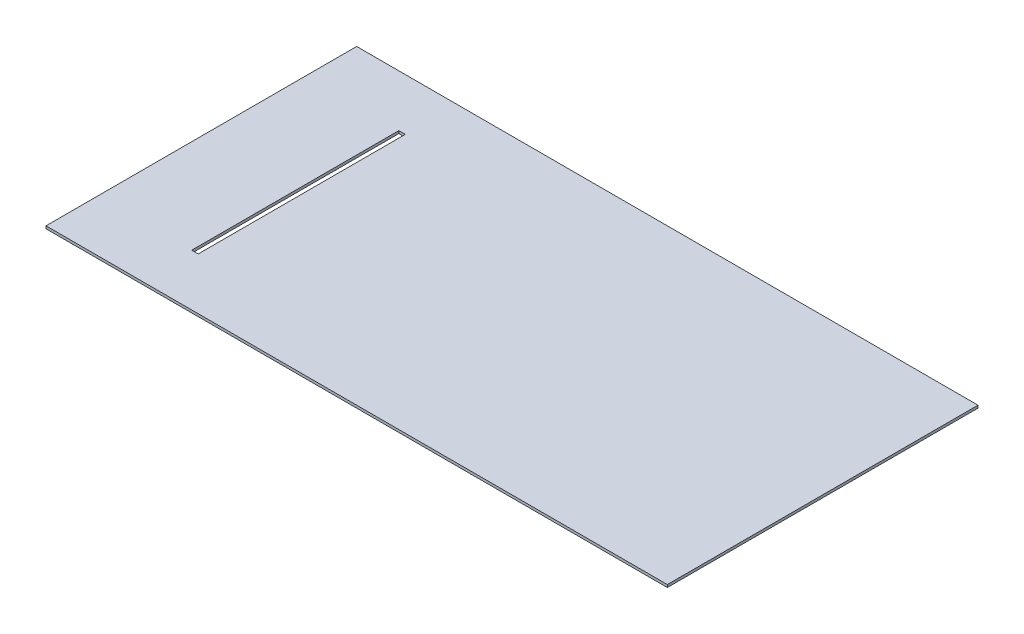
ISO-10303-21;
HEADER;
FILE_DESCRIPTION(('STEP AP214'),'2;1');
FILE_NAME('part.step','',(''),(''),'','','');
FILE_SCHEMA(('AUTOMOTIVE_DESIGN { 1 0 10303 214 1 1 1 1 }'));
ENDSEC;
DATA;
#1=APPLICATION_CONTEXT('core data for automotive mechanical design processes');
#2=APPLICATION_PROTOCOL_DEFINITION('international standard','automotive_design',2000,#1);
#3=PRODUCT_CONTEXT('',#1,'mechanical');
#4=PRODUCT('Part','Part','',(#3));
#5=PRODUCT_RELATED_PRODUCT_CATEGORY('part','',(#4));
#6=PRODUCT_DEFINITION_FORMATION('','',#4);
#7=PRODUCT_DEFINITION_CONTEXT('part definition',#1,'design');
#8=PRODUCT_DEFINITION('design','',#6,#7);
#9=PRODUCT_DEFINITION_SHAPE('','',#8);
#10=(LENGTH_UNIT() NAMED_UNIT(*) SI_UNIT(.MILLI.,.METRE.));
#11=(NAMED_UNIT(*) PLANE_ANGLE_UNIT() SI_UNIT($,.RADIAN.));
#12=(NAMED_UNIT(*) SI_UNIT($,.STERADIAN.) SOLID_ANGLE_UNIT());
#13=UNCERTAINTY_MEASURE_WITH_UNIT(LENGTH_MEASURE(1.E-05),#10,'distance_accuracy_value','');
#14=(GEOMETRIC_REPRESENTATION_CONTEXT(3) GLOBAL_UNCERTAINTY_ASSIGNED_CONTEXT((#13)) GLOBAL_UNIT_ASSIGNED_CONTEXT((#10,
#11,#12)) REPRESENTATION_CONTEXT('',''));
#15=CARTESIAN_POINT('',(0.,0.,0.));
#16=DIRECTION('',(0.,0.,1.));
#17=DIRECTION('',(1.,0.,0.));
#18=AXIS2_PLACEMENT_3D('',#15,#16,#17);
#19=CARTESIAN_POINT('',(0.,2.54,0.));
#20=DIRECTION('',(1.,0.,0.));
#21=DIRECTION('',(0.,0.,-1.));
#22=AXIS2_PLACEMENT_3D('',#19,#20,#21);
#23=PLANE('',#22);
#24=DIRECTION('',(0.,0.,1.));
#25=VECTOR('',#24,1.);
#26=CARTESIAN_POINT('',(0.,0.,0.));
#27=LINE('',#26,#25);
#28=CARTESIAN_POINT('',(0.,0.,-304.8));
#29=VERTEX_POINT('',#28);
#30=CARTESIAN_POINT('',(0.,0.,0.));
#31=VERTEX_POINT('',#30);
#32=EDGE_CURVE('E123',#29,#31,#27,.T.);
#33=ORIENTED_EDGE('',*,*,#32,.T.);
#34=DIRECTION('',(0.,-1.,0.));
#35=VECTOR('',#34,1.);
#36=CARTESIAN_POINT('',(0.,2.54,0.));
#37=LINE('',#36,#35);
#38=CARTESIAN_POINT('',(0.,2.54,0.));
#39=VERTEX_POINT('',#38);
#40=EDGE_CURVE('E152',#39,#31,#37,.T.);
#41=ORIENTED_EDGE('',*,*,#40,.F.);
#42=DIRECTION('',(0.,0.,1.));
#43=VECTOR('',#42,1.);
#44=CARTESIAN_POINT('',(0.,2.54,0.));
#45=LINE('',#44,#43);
#46=CARTESIAN_POINT('',(0.,2.54,-304.8));
#47=VERTEX_POINT('',#46);
#48=EDGE_CURVE('E126',#47,#39,#45,.T.);
#49=ORIENTED_EDGE('',*,*,#48,.F.);
#50=DIRECTION('',(0.,-1.,0.));
#51=VECTOR('',#50,1.);
#52=CARTESIAN_POINT('',(0.,2.54,-304.8));
#53=LINE('',#52,#51);
#54=EDGE_CURVE('E136',#47,#29,#53,.T.);
#55=ORIENTED_EDGE('',*,*,#54,.T.);
#56=EDGE_LOOP('',(#33,#41,#49,#55));
#57=FACE_BOUND('',#56,.T.);
#58=ADVANCED_FACE('F34',(#57),#23,.F.);
#59=CARTESIAN_POINT('',(0.,2.54,0.));
#60=DIRECTION('',(0.,0.,-1.));
#61=DIRECTION('',(-1.,0.,0.));
#62=AXIS2_PLACEMENT_3D('',#59,#60,#61);
#63=PLANE('',#62);
#64=DIRECTION('',(1.,0.,0.));
#65=VECTOR('',#64,1.);
#66=CARTESIAN_POINT('',(0.,0.,0.));
#67=LINE('',#66,#65);
#68=CARTESIAN_POINT('',(609.6,0.,0.));
#69=VERTEX_POINT('',#68);
#70=EDGE_CURVE('E139',#31,#69,#67,.T.);
#71=ORIENTED_EDGE('',*,*,#70,.T.);
#72=DIRECTION('',(0.,-1.,0.));
#73=VECTOR('',#72,1.);
#74=CARTESIAN_POINT('',(609.6,2.54,0.));
#75=LINE('',#74,#73);
#76=CARTESIAN_POINT('',(609.6,2.54,0.));
#77=VERTEX_POINT('',#76);
#78=EDGE_CURVE('E149',#77,#69,#75,.T.);
#79=ORIENTED_EDGE('',*,*,#78,.F.);
#80=DIRECTION('',(1.,0.,0.));
#81=VECTOR('',#80,1.);
#82=CARTESIAN_POINT('',(0.,2.54,0.));
#83=LINE('',#82,#81);
#84=EDGE_CURVE('E129',#39,#77,#83,.T.);
#85=ORIENTED_EDGE('',*,*,#84,.F.);
#86=ORIENTED_EDGE('',*,*,#40,.T.);
#87=EDGE_LOOP('',(#71,#79,#85,#86));
#88=FACE_BOUND('',#87,.T.);
#89=ADVANCED_FACE('F177',(#88),#63,.F.);
#90=CARTESIAN_POINT('',(609.6,2.54,0.));
#91=DIRECTION('',(-1.,0.,0.));
#92=DIRECTION('',(0.,0.,1.));
#93=AXIS2_PLACEMENT_3D('',#90,#91,#92);
#94=PLANE('',#93);
#95=DIRECTION('',(0.,0.,-1.));
#96=VECTOR('',#95,1.);
#97=CARTESIAN_POINT('',(609.6,0.,0.));
#98=LINE('',#97,#96);
#99=CARTESIAN_POINT('',(609.6,0.,-304.8));
#100=VERTEX_POINT('',#99);
#101=EDGE_CURVE('E141',#69,#100,#98,.T.);
#102=ORIENTED_EDGE('',*,*,#101,.T.);
#103=DIRECTION('',(0.,-1.,0.));
#104=VECTOR('',#103,1.);
#105=CARTESIAN_POINT('',(609.6,2.54,-304.8));
#106=LINE('',#105,#104);
#107=CARTESIAN_POINT('',(609.6,2.54,-304.8));
#108=VERTEX_POINT('',#107);
#109=EDGE_CURVE('E146',#108,#100,#106,.T.);
#110=ORIENTED_EDGE('',*,*,#109,.F.);
#111=DIRECTION('',(0.,0.,-1.));
#112=VECTOR('',#111,1.);
#113=CARTESIAN_POINT('',(609.6,2.54,0.));
#114=LINE('',#113,#112);
#115=EDGE_CURVE('E132',#77,#108,#114,.T.);
#116=ORIENTED_EDGE('',*,*,#115,.F.);
#117=ORIENTED_EDGE('',*,*,#78,.T.);
#118=EDGE_LOOP('',(#102,#110,#116,#117));
#119=FACE_BOUND('',#118,.T.);
#120=ADVANCED_FACE('F182',(#119),#94,.F.);
#121=CARTESIAN_POINT('',(0.,2.54,-304.8));
#122=DIRECTION('',(0.,0.,1.));
#123=DIRECTION('',(1.,0.,0.));
#124=AXIS2_PLACEMENT_3D('',#121,#122,#123);
#125=PLANE('',#124);
#126=DIRECTION('',(-1.,0.,0.));
#127=VECTOR('',#126,1.);
#128=CARTESIAN_POINT('',(0.,0.,-304.8));
#129=LINE('',#128,#127);
#130=EDGE_CURVE('E130',#100,#29,#129,.T.);
#131=ORIENTED_EDGE('',*,*,#130,.T.);
#132=ORIENTED_EDGE('',*,*,#54,.F.);
#133=DIRECTION('',(-1.,0.,0.));
#134=VECTOR('',#133,1.);
#135=CARTESIAN_POINT('',(0.,2.54,-304.8));
#136=LINE('',#135,#134);
#137=EDGE_CURVE('E134',#108,#47,#136,.T.);
#138=ORIENTED_EDGE('',*,*,#137,.F.);
#139=ORIENTED_EDGE('',*,*,#109,.T.);
#140=EDGE_LOOP('',(#131,#132,#138,#139));
#141=FACE_BOUND('',#140,.T.);
#142=ADVANCED_FACE('F195',(#141),#125,.F.);
#143=CARTESIAN_POINT('',(0.,2.54,0.));
#144=DIRECTION('',(0.,-1.,0.));
#145=DIRECTION('',(0.,0.,-1.));
#146=AXIS2_PLACEMENT_3D('',#143,#144,#145);
#147=PLANE('',#146);
#148=DIRECTION('',(1.,0.,0.));
#149=VECTOR('',#148,1.);
#150=CARTESIAN_POINT('',(92.2035103181571,2.54,-50.8));
#151=LINE('',#150,#149);
#152=CARTESIAN_POINT('',(92.2035103181571,2.54,-50.8));
#153=VERTEX_POINT('',#152);
#154=CARTESIAN_POINT('',(98.5535103181571,2.54,-50.8));
#155=VERTEX_POINT('',#154);
#156=EDGE_CURVE('E109',#153,#155,#151,.T.);
#157=ORIENTED_EDGE('',*,*,#156,.F.);
#158=DIRECTION('',(0.,0.,1.));
#159=VECTOR('',#158,1.);
#160=CARTESIAN_POINT('',(92.2035103181571,2.54,-254.));
#161=LINE('',#160,#159);
#162=CARTESIAN_POINT('',(92.2035103181571,2.54,-254.));
#163=VERTEX_POINT('',#162);
#164=EDGE_CURVE('E48',#163,#153,#161,.T.);
#165=ORIENTED_EDGE('',*,*,#164,.F.);
#166=DIRECTION('',(-1.,0.,0.));
#167=VECTOR('',#166,1.);
#168=CARTESIAN_POINT('',(92.2035103181571,2.54,-254.));
#169=LINE('',#168,#167);
#170=CARTESIAN_POINT('',(98.5535103181571,2.54,-254.));
#171=VERTEX_POINT('',#170);
#172=EDGE_CURVE('E116',#171,#163,#169,.T.);
#173=ORIENTED_EDGE('',*,*,#172,.F.);
#174=DIRECTION('',(0.,0.,-1.));
#175=VECTOR('',#174,1.);
#176=CARTESIAN_POINT('',(98.5535103181571,2.54,-254.));
#177=LINE('',#176,#175);
#178=EDGE_CURVE('E100',#155,#171,#177,.T.);
#179=ORIENTED_EDGE('',*,*,#178,.F.);
#180=EDGE_LOOP('',(#157,#165,#173,#179));
#181=FACE_BOUND('',#180,.T.);
#182=ORIENTED_EDGE('',*,*,#48,.T.);
#183=ORIENTED_EDGE('',*,*,#84,.T.);
#184=ORIENTED_EDGE('',*,*,#115,.T.);
#185=ORIENTED_EDGE('',*,*,#137,.T.);
#186=EDGE_LOOP('',(#182,#183,#184,#185));
#187=FACE_BOUND('',#186,.T.);
#188=ADVANCED_FACE('F113',(#181,#187),#147,.F.);
#189=CARTESIAN_POINT('',(0.,0.,0.));
#190=DIRECTION('',(0.,-1.,0.));
#191=DIRECTION('',(0.,0.,-1.));
#192=AXIS2_PLACEMENT_3D('',#189,#190,#191);
#193=PLANE('',#192);
#194=DIRECTION('',(0.,0.,-1.));
#195=VECTOR('',#194,1.);
#196=CARTESIAN_POINT('',(92.2035103181571,0.,0.));
#197=LINE('',#196,#195);
#198=CARTESIAN_POINT('',(92.2035103181571,0.,-50.8));
#199=VERTEX_POINT('',#198);
#200=CARTESIAN_POINT('',(92.2035103181571,0.,-254.));
#201=VERTEX_POINT('',#200);
#202=EDGE_CURVE('E11',#199,#201,#197,.T.);
#203=ORIENTED_EDGE('',*,*,#202,.F.);
#204=DIRECTION('',(-1.,0.,0.));
#205=VECTOR('',#204,1.);
#206=CARTESIAN_POINT('',(0.,0.,-50.8));
#207=LINE('',#206,#205);
#208=CARTESIAN_POINT('',(98.5535103181571,0.,-50.8));
#209=VERTEX_POINT('',#208);
#210=EDGE_CURVE('E155',#209,#199,#207,.T.);
#211=ORIENTED_EDGE('',*,*,#210,.F.);
#212=DIRECTION('',(0.,0.,1.));
#213=VECTOR('',#212,1.);
#214=CARTESIAN_POINT('',(98.5535103181571,0.,0.));
#215=LINE('',#214,#213);
#216=CARTESIAN_POINT('',(98.5535103181571,0.,-254.));
#217=VERTEX_POINT('',#216);
#218=EDGE_CURVE('E103',#217,#209,#215,.T.);
#219=ORIENTED_EDGE('',*,*,#218,.F.);
#220=DIRECTION('',(1.,0.,0.));
#221=VECTOR('',#220,1.);
#222=CARTESIAN_POINT('',(0.,0.,-254.));
#223=LINE('',#222,#221);
#224=EDGE_CURVE('E41',#201,#217,#223,.T.);
#225=ORIENTED_EDGE('',*,*,#224,.F.);
#226=EDGE_LOOP('',(#203,#211,#219,#225));
#227=FACE_BOUND('',#226,.T.);
#228=ORIENTED_EDGE('',*,*,#32,.F.);
#229=ORIENTED_EDGE('',*,*,#130,.F.);
#230=ORIENTED_EDGE('',*,*,#101,.F.);
#231=ORIENTED_EDGE('',*,*,#70,.F.);
#232=EDGE_LOOP('',(#228,#229,#230,#231));
#233=FACE_BOUND('',#232,.T.);
#234=ADVANCED_FACE('F163',(#227,#233),#193,.T.);
#235=CARTESIAN_POINT('',(92.2035103181571,-52.324,-254.));
#236=DIRECTION('',(-1.,0.,0.));
#237=DIRECTION('',(0.,0.,1.));
#238=AXIS2_PLACEMENT_3D('',#235,#236,#237);
#239=PLANE('',#238);
#240=ORIENTED_EDGE('',*,*,#202,.T.);
#241=DIRECTION('',(0.,1.,0.));
#242=VECTOR('',#241,1.);
#243=CARTESIAN_POINT('',(92.2035103181571,-52.324,-254.));
#244=LINE('',#243,#242);
#245=EDGE_CURVE('E121',#201,#163,#244,.T.);
#246=ORIENTED_EDGE('',*,*,#245,.T.);
#247=ORIENTED_EDGE('',*,*,#164,.T.);
#248=DIRECTION('',(0.,1.,0.));
#249=VECTOR('',#248,1.);
#250=CARTESIAN_POINT('',(92.2035103181571,-52.324,-50.8));
#251=LINE('',#250,#249);
#252=EDGE_CURVE('E106',#199,#153,#251,.T.);
#253=ORIENTED_EDGE('',*,*,#252,.F.);
#254=EDGE_LOOP('',(#240,#246,#247,#253));
#255=FACE_BOUND('',#254,.T.);
#256=ADVANCED_FACE('F165',(#255),#239,.F.);
#257=CARTESIAN_POINT('',(92.2035103181571,-52.324,-254.));
#258=DIRECTION('',(0.,0.,-1.));
#259=DIRECTION('',(-1.,0.,0.));
#260=AXIS2_PLACEMENT_3D('',#257,#258,#259);
#261=PLANE('',#260);
#262=ORIENTED_EDGE('',*,*,#224,.T.);
#263=DIRECTION('',(0.,1.,0.));
#264=VECTOR('',#263,1.);
#265=CARTESIAN_POINT('',(98.5535103181571,-52.324,-254.));
#266=LINE('',#265,#264);
#267=EDGE_CURVE('E105',#217,#171,#266,.T.);
#268=ORIENTED_EDGE('',*,*,#267,.T.);
#269=ORIENTED_EDGE('',*,*,#172,.T.);
#270=ORIENTED_EDGE('',*,*,#245,.F.);
#271=EDGE_LOOP('',(#262,#268,#269,#270));
#272=FACE_BOUND('',#271,.T.);
#273=ADVANCED_FACE('F160',(#272),#261,.F.);
#274=CARTESIAN_POINT('',(98.5535103181571,-52.324,-254.));
#275=DIRECTION('',(1.,0.,0.));
#276=DIRECTION('',(0.,0.,-1.));
#277=AXIS2_PLACEMENT_3D('',#274,#275,#276);
#278=PLANE('',#277);
#279=ORIENTED_EDGE('',*,*,#218,.T.);
#280=DIRECTION('',(0.,1.,0.));
#281=VECTOR('',#280,1.);
#282=CARTESIAN_POINT('',(98.5535103181571,-52.324,-50.8));
#283=LINE('',#282,#281);
#284=EDGE_CURVE('E56',#209,#155,#283,.T.);
#285=ORIENTED_EDGE('',*,*,#284,.T.);
#286=ORIENTED_EDGE('',*,*,#178,.T.);
#287=ORIENTED_EDGE('',*,*,#267,.F.);
#288=EDGE_LOOP('',(#279,#285,#286,#287));
#289=FACE_BOUND('',#288,.T.);
#290=ADVANCED_FACE('F97',(#289),#278,.F.);
#291=CARTESIAN_POINT('',(92.2035103181571,-52.324,-50.8));
#292=DIRECTION('',(0.,0.,1.));
#293=DIRECTION('',(1.,0.,0.));
#294=AXIS2_PLACEMENT_3D('',#291,#292,#293);
#295=PLANE('',#294);
#296=ORIENTED_EDGE('',*,*,#210,.T.);
#297=ORIENTED_EDGE('',*,*,#252,.T.);
#298=ORIENTED_EDGE('',*,*,#156,.T.);
#299=ORIENTED_EDGE('',*,*,#284,.F.);
#300=EDGE_LOOP('',(#296,#297,#298,#299));
#301=FACE_BOUND('',#300,.T.);
#302=ADVANCED_FACE('F110',(#301),#295,.F.);
#303=CLOSED_SHELL('',(#58,#89,#120,#142,#188,#234,#256,#273,#290,#302));
#304=MANIFOLD_SOLID_BREP('B2',#303);
#305=ADVANCED_BREP_SHAPE_REPRESENTATION('',(#18,#304),#14);
#306=SHAPE_DEFINITION_REPRESENTATION(#9,#305);
ENDSEC;
END-ISO-10303-21;
